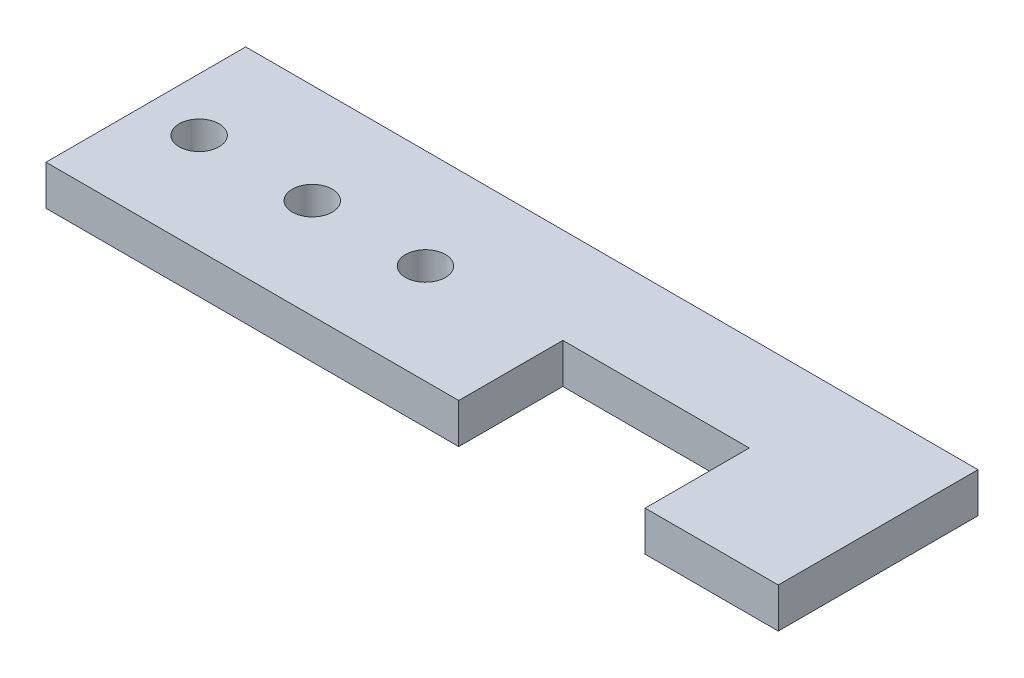
ISO-10303-21;
HEADER;
FILE_DESCRIPTION(('STEP AP214'),'2;1');
FILE_NAME('part.step','',(''),(''),'','','');
FILE_SCHEMA(('AUTOMOTIVE_DESIGN { 1 0 10303 214 1 1 1 1 }'));
ENDSEC;
DATA;
#1=APPLICATION_CONTEXT('core data for automotive mechanical design processes');
#2=APPLICATION_PROTOCOL_DEFINITION('international standard','automotive_design',2000,#1);
#3=PRODUCT_CONTEXT('',#1,'mechanical');
#4=PRODUCT('Part','Part','',(#3));
#5=PRODUCT_RELATED_PRODUCT_CATEGORY('part','',(#4));
#6=PRODUCT_DEFINITION_FORMATION('','',#4);
#7=PRODUCT_DEFINITION_CONTEXT('part definition',#1,'design');
#8=PRODUCT_DEFINITION('design','',#6,#7);
#9=PRODUCT_DEFINITION_SHAPE('','',#8);
#10=(LENGTH_UNIT() NAMED_UNIT(*) SI_UNIT(.MILLI.,.METRE.));
#11=(NAMED_UNIT(*) PLANE_ANGLE_UNIT() SI_UNIT($,.RADIAN.));
#12=(NAMED_UNIT(*) SI_UNIT($,.STERADIAN.) SOLID_ANGLE_UNIT());
#13=UNCERTAINTY_MEASURE_WITH_UNIT(LENGTH_MEASURE(1.E-05),#10,'distance_accuracy_value','');
#14=(GEOMETRIC_REPRESENTATION_CONTEXT(3) GLOBAL_UNCERTAINTY_ASSIGNED_CONTEXT((#13)) GLOBAL_UNIT_ASSIGNED_CONTEXT((#10,
#11,#12)) REPRESENTATION_CONTEXT('',''));
#15=CARTESIAN_POINT('',(0.,0.,0.));
#16=DIRECTION('',(0.,0.,1.));
#17=DIRECTION('',(1.,0.,0.));
#18=AXIS2_PLACEMENT_3D('',#15,#16,#17);
#19=CARTESIAN_POINT('',(0.,3.,-7.82030355510657));
#20=DIRECTION('',(0.,0.,-1.));
#21=DIRECTION('',(-1.,0.,0.));
#22=AXIS2_PLACEMENT_3D('',#19,#20,#21);
#23=PLANE('',#22);
#24=DIRECTION('',(1.,0.,0.));
#25=VECTOR('',#24,1.);
#26=CARTESIAN_POINT('',(0.,0.,-7.82030355510657));
#27=LINE('',#26,#25);
#28=CARTESIAN_POINT('',(31.,0.,-7.82030355510657));
#29=VERTEX_POINT('',#28);
#30=CARTESIAN_POINT('',(45.,0.,-7.82030355510657));
#31=VERTEX_POINT('',#30);
#32=EDGE_CURVE('E143',#29,#31,#27,.T.);
#33=ORIENTED_EDGE('',*,*,#32,.T.);
#34=DIRECTION('',(0.,-1.,0.));
#35=VECTOR('',#34,1.);
#36=CARTESIAN_POINT('',(45.,3.,-7.82030355510657));
#37=LINE('',#36,#35);
#38=CARTESIAN_POINT('',(45.,3.,-7.82030355510657));
#39=VERTEX_POINT('',#38);
#40=EDGE_CURVE('E11',#39,#31,#37,.T.);
#41=ORIENTED_EDGE('',*,*,#40,.F.);
#42=DIRECTION('',(1.,0.,0.));
#43=VECTOR('',#42,1.);
#44=CARTESIAN_POINT('',(0.,3.,-7.82030355510657));
#45=LINE('',#44,#43);
#46=CARTESIAN_POINT('',(31.,3.,-7.82030355510657));
#47=VERTEX_POINT('',#46);
#48=EDGE_CURVE('E183',#47,#39,#45,.T.);
#49=ORIENTED_EDGE('',*,*,#48,.F.);
#50=DIRECTION('',(0.,-1.,0.));
#51=VECTOR('',#50,1.);
#52=CARTESIAN_POINT('',(31.,3.,-7.82030355510657));
#53=LINE('',#52,#51);
#54=EDGE_CURVE('E133',#47,#29,#53,.T.);
#55=ORIENTED_EDGE('',*,*,#54,.T.);
#56=EDGE_LOOP('',(#33,#41,#49,#55));
#57=FACE_BOUND('',#56,.T.);
#58=ADVANCED_FACE('F35',(#57),#23,.F.);
#59=CARTESIAN_POINT('',(45.,3.,0.));
#60=DIRECTION('',(1.,0.,0.));
#61=DIRECTION('',(0.,0.,-1.));
#62=AXIS2_PLACEMENT_3D('',#59,#60,#61);
#63=PLANE('',#62);
#64=DIRECTION('',(0.,0.,1.));
#65=VECTOR('',#64,1.);
#66=CARTESIAN_POINT('',(45.,0.,0.));
#67=LINE('',#66,#65);
#68=CARTESIAN_POINT('',(45.,0.,0.));
#69=VERTEX_POINT('',#68);
#70=EDGE_CURVE('E146',#31,#69,#67,.T.);
#71=ORIENTED_EDGE('',*,*,#70,.T.);
#72=DIRECTION('',(0.,-1.,0.));
#73=VECTOR('',#72,1.);
#74=CARTESIAN_POINT('',(45.,3.,0.));
#75=LINE('',#74,#73);
#76=CARTESIAN_POINT('',(45.,3.,0.));
#77=VERTEX_POINT('',#76);
#78=EDGE_CURVE('E44',#77,#69,#75,.T.);
#79=ORIENTED_EDGE('',*,*,#78,.F.);
#80=DIRECTION('',(0.,0.,1.));
#81=VECTOR('',#80,1.);
#82=CARTESIAN_POINT('',(45.,3.,0.));
#83=LINE('',#82,#81);
#84=EDGE_CURVE('E94',#39,#77,#83,.T.);
#85=ORIENTED_EDGE('',*,*,#84,.F.);
#86=ORIENTED_EDGE('',*,*,#40,.T.);
#87=EDGE_LOOP('',(#71,#79,#85,#86));
#88=FACE_BOUND('',#87,.T.);
#89=ADVANCED_FACE('F219',(#88),#63,.F.);
#90=CARTESIAN_POINT('',(0.,3.,0.));
#91=DIRECTION('',(0.,0.,-1.));
#92=DIRECTION('',(-1.,0.,0.));
#93=AXIS2_PLACEMENT_3D('',#90,#91,#92);
#94=PLANE('',#93);
#95=DIRECTION('',(1.,0.,0.));
#96=VECTOR('',#95,1.);
#97=CARTESIAN_POINT('',(0.,0.,0.));
#98=LINE('',#97,#96);
#99=CARTESIAN_POINT('',(55.,0.,0.));
#100=VERTEX_POINT('',#99);
#101=EDGE_CURVE('E148',#69,#100,#98,.T.);
#102=ORIENTED_EDGE('',*,*,#101,.T.);
#103=DIRECTION('',(0.,-1.,0.));
#104=VECTOR('',#103,1.);
#105=CARTESIAN_POINT('',(55.,3.,0.));
#106=LINE('',#105,#104);
#107=CARTESIAN_POINT('',(55.,3.,0.));
#108=VERTEX_POINT('',#107);
#109=EDGE_CURVE('E164',#108,#100,#106,.T.);
#110=ORIENTED_EDGE('',*,*,#109,.F.);
#111=DIRECTION('',(1.,0.,0.));
#112=VECTOR('',#111,1.);
#113=CARTESIAN_POINT('',(0.,3.,0.));
#114=LINE('',#113,#112);
#115=EDGE_CURVE('E122',#77,#108,#114,.T.);
#116=ORIENTED_EDGE('',*,*,#115,.F.);
#117=ORIENTED_EDGE('',*,*,#78,.T.);
#118=EDGE_LOOP('',(#102,#110,#116,#117));
#119=FACE_BOUND('',#118,.T.);
#120=ADVANCED_FACE('F170',(#119),#94,.F.);
#121=CARTESIAN_POINT('',(55.,3.,0.));
#122=DIRECTION('',(-1.,0.,0.));
#123=DIRECTION('',(0.,0.,1.));
#124=AXIS2_PLACEMENT_3D('',#121,#122,#123);
#125=PLANE('',#124);
#126=DIRECTION('',(0.,0.,-1.));
#127=VECTOR('',#126,1.);
#128=CARTESIAN_POINT('',(55.,0.,0.));
#129=LINE('',#128,#127);
#130=CARTESIAN_POINT('',(55.,0.,-15.));
#131=VERTEX_POINT('',#130);
#132=EDGE_CURVE('E150',#100,#131,#129,.T.);
#133=ORIENTED_EDGE('',*,*,#132,.T.);
#134=DIRECTION('',(0.,-1.,0.));
#135=VECTOR('',#134,1.);
#136=CARTESIAN_POINT('',(55.,3.,-15.));
#137=LINE('',#136,#135);
#138=CARTESIAN_POINT('',(55.,3.,-15.));
#139=VERTEX_POINT('',#138);
#140=EDGE_CURVE('E162',#139,#131,#137,.T.);
#141=ORIENTED_EDGE('',*,*,#140,.F.);
#142=DIRECTION('',(0.,0.,-1.));
#143=VECTOR('',#142,1.);
#144=CARTESIAN_POINT('',(55.,3.,0.));
#145=LINE('',#144,#143);
#146=EDGE_CURVE('E128',#108,#139,#145,.T.);
#147=ORIENTED_EDGE('',*,*,#146,.F.);
#148=ORIENTED_EDGE('',*,*,#109,.T.);
#149=EDGE_LOOP('',(#133,#141,#147,#148));
#150=FACE_BOUND('',#149,.T.);
#151=ADVANCED_FACE('F179',(#150),#125,.F.);
#152=CARTESIAN_POINT('',(0.,3.,-15.));
#153=DIRECTION('',(0.,0.,-1.));
#154=DIRECTION('',(-1.,0.,0.));
#155=AXIS2_PLACEMENT_3D('',#152,#153,#154);
#156=PLANE('',#155);
#157=DIRECTION('',(1.,0.,0.));
#158=VECTOR('',#157,1.);
#159=CARTESIAN_POINT('',(0.,0.,-15.));
#160=LINE('',#159,#158);
#161=CARTESIAN_POINT('',(0.,0.,-15.));
#162=VERTEX_POINT('',#161);
#163=EDGE_CURVE('E153',#162,#131,#160,.T.);
#164=ORIENTED_EDGE('',*,*,#163,.F.);
#165=DIRECTION('',(0.,-1.,0.));
#166=VECTOR('',#165,1.);
#167=CARTESIAN_POINT('',(0.,3.,-15.));
#168=LINE('',#167,#166);
#169=CARTESIAN_POINT('',(0.,3.,-15.));
#170=VERTEX_POINT('',#169);
#171=EDGE_CURVE('E116',#170,#162,#168,.T.);
#172=ORIENTED_EDGE('',*,*,#171,.F.);
#173=DIRECTION('',(1.,0.,0.));
#174=VECTOR('',#173,1.);
#175=CARTESIAN_POINT('',(0.,3.,-15.));
#176=LINE('',#175,#174);
#177=EDGE_CURVE('E126',#170,#139,#176,.T.);
#178=ORIENTED_EDGE('',*,*,#177,.T.);
#179=ORIENTED_EDGE('',*,*,#140,.T.);
#180=EDGE_LOOP('',(#164,#172,#178,#179));
#181=FACE_BOUND('',#180,.T.);
#182=ADVANCED_FACE('F244',(#181),#156,.T.);
#183=CARTESIAN_POINT('',(0.,3.,0.));
#184=DIRECTION('',(-1.,0.,0.));
#185=DIRECTION('',(0.,0.,1.));
#186=AXIS2_PLACEMENT_3D('',#183,#184,#185);
#187=PLANE('',#186);
#188=DIRECTION('',(0.,0.,-1.));
#189=VECTOR('',#188,1.);
#190=CARTESIAN_POINT('',(0.,0.,0.));
#191=LINE('',#190,#189);
#192=CARTESIAN_POINT('',(0.,0.,0.));
#193=VERTEX_POINT('',#192);
#194=EDGE_CURVE('E115',#193,#162,#191,.T.);
#195=ORIENTED_EDGE('',*,*,#194,.F.);
#196=DIRECTION('',(0.,-1.,0.));
#197=VECTOR('',#196,1.);
#198=CARTESIAN_POINT('',(0.,3.,0.));
#199=LINE('',#198,#197);
#200=CARTESIAN_POINT('',(0.,3.,0.));
#201=VERTEX_POINT('',#200);
#202=EDGE_CURVE('E109',#201,#193,#199,.T.);
#203=ORIENTED_EDGE('',*,*,#202,.F.);
#204=DIRECTION('',(0.,0.,-1.));
#205=VECTOR('',#204,1.);
#206=CARTESIAN_POINT('',(0.,3.,0.));
#207=LINE('',#206,#205);
#208=EDGE_CURVE('E113',#201,#170,#207,.T.);
#209=ORIENTED_EDGE('',*,*,#208,.T.);
#210=ORIENTED_EDGE('',*,*,#171,.T.);
#211=EDGE_LOOP('',(#195,#203,#209,#210));
#212=FACE_BOUND('',#211,.T.);
#213=ADVANCED_FACE('F111',(#212),#187,.T.);
#214=CARTESIAN_POINT('',(31.,0.,0.));
#215=VERTEX_POINT('',#214);
#216=EDGE_CURVE('E80',#193,#215,#98,.T.);
#217=ORIENTED_EDGE('',*,*,#216,.T.);
#218=DIRECTION('',(0.,-1.,0.));
#219=VECTOR('',#218,1.);
#220=CARTESIAN_POINT('',(31.,3.,0.));
#221=LINE('',#220,#219);
#222=CARTESIAN_POINT('',(31.,3.,0.));
#223=VERTEX_POINT('',#222);
#224=EDGE_CURVE('E117',#223,#215,#221,.T.);
#225=ORIENTED_EDGE('',*,*,#224,.F.);
#226=EDGE_CURVE('E119',#201,#223,#114,.T.);
#227=ORIENTED_EDGE('',*,*,#226,.F.);
#228=ORIENTED_EDGE('',*,*,#202,.T.);
#229=EDGE_LOOP('',(#217,#225,#227,#228));
#230=FACE_BOUND('',#229,.T.);
#231=ADVANCED_FACE('F120',(#230),#94,.F.);
#232=CARTESIAN_POINT('',(4.,3.,-7.5));
#233=DIRECTION('',(0.,-1.,0.));
#234=DIRECTION('',(0.,0.,-1.));
#235=AXIS2_PLACEMENT_3D('',#232,#233,#234);
#236=CYLINDRICAL_SURFACE('',#235,1.5);
#237=CARTESIAN_POINT('',(4.,3.,-7.5));
#238=DIRECTION('',(0.,1.,0.));
#239=DIRECTION('',(0.,0.,1.));
#240=AXIS2_PLACEMENT_3D('',#237,#238,#239);
#241=CIRCLE('',#240,1.5);
#242=CARTESIAN_POINT('',(4.,3.,-6.));
#243=VERTEX_POINT('',#242);
#244=EDGE_CURVE('E185',#243,#243,#241,.T.);
#245=ORIENTED_EDGE('',*,*,#244,.T.);
#246=EDGE_LOOP('',(#245));
#247=FACE_BOUND('',#246,.T.);
#248=CARTESIAN_POINT('',(4.,0.,-7.5));
#249=DIRECTION('',(0.,1.,0.));
#250=DIRECTION('',(0.,0.,1.));
#251=AXIS2_PLACEMENT_3D('',#248,#249,#250);
#252=CIRCLE('',#251,1.5);
#253=CARTESIAN_POINT('',(4.,0.,-6.));
#254=VERTEX_POINT('',#253);
#255=EDGE_CURVE('E140',#254,#254,#252,.T.);
#256=ORIENTED_EDGE('',*,*,#255,.F.);
#257=EDGE_LOOP('',(#256));
#258=FACE_BOUND('',#257,.T.);
#259=ADVANCED_FACE('F204',(#247,#258),#236,.F.);
#260=CARTESIAN_POINT('',(12.5,3.,-7.5));
#261=DIRECTION('',(0.,-1.,0.));
#262=DIRECTION('',(0.,0.,-1.));
#263=AXIS2_PLACEMENT_3D('',#260,#261,#262);
#264=CYLINDRICAL_SURFACE('',#263,1.5);
#265=CARTESIAN_POINT('',(12.5,3.,-7.5));
#266=DIRECTION('',(0.,1.,0.));
#267=DIRECTION('',(0.,0.,1.));
#268=AXIS2_PLACEMENT_3D('',#265,#266,#267);
#269=CIRCLE('',#268,1.5);
#270=CARTESIAN_POINT('',(12.5,3.,-6.));
#271=VERTEX_POINT('',#270);
#272=EDGE_CURVE('E188',#271,#271,#269,.T.);
#273=ORIENTED_EDGE('',*,*,#272,.T.);
#274=EDGE_LOOP('',(#273));
#275=FACE_BOUND('',#274,.T.);
#276=CARTESIAN_POINT('',(12.5,0.,-7.5));
#277=DIRECTION('',(0.,1.,0.));
#278=DIRECTION('',(0.,0.,1.));
#279=AXIS2_PLACEMENT_3D('',#276,#277,#278);
#280=CIRCLE('',#279,1.5);
#281=CARTESIAN_POINT('',(12.5,0.,-6.));
#282=VERTEX_POINT('',#281);
#283=EDGE_CURVE('E137',#282,#282,#280,.T.);
#284=ORIENTED_EDGE('',*,*,#283,.F.);
#285=EDGE_LOOP('',(#284));
#286=FACE_BOUND('',#285,.T.);
#287=ADVANCED_FACE('F207',(#275,#286),#264,.F.);
#288=CARTESIAN_POINT('',(21.,3.,-7.5));
#289=DIRECTION('',(0.,-1.,0.));
#290=DIRECTION('',(0.,0.,-1.));
#291=AXIS2_PLACEMENT_3D('',#288,#289,#290);
#292=CYLINDRICAL_SURFACE('',#291,1.5);
#293=CARTESIAN_POINT('',(21.,3.,-7.5));
#294=DIRECTION('',(0.,1.,0.));
#295=DIRECTION('',(0.,0.,1.));
#296=AXIS2_PLACEMENT_3D('',#293,#294,#295);
#297=CIRCLE('',#296,1.5);
#298=CARTESIAN_POINT('',(21.,3.,-6.));
#299=VERTEX_POINT('',#298);
#300=EDGE_CURVE('E158',#299,#299,#297,.T.);
#301=ORIENTED_EDGE('',*,*,#300,.T.);
#302=EDGE_LOOP('',(#301));
#303=FACE_BOUND('',#302,.T.);
#304=CARTESIAN_POINT('',(21.,0.,-7.5));
#305=DIRECTION('',(0.,1.,0.));
#306=DIRECTION('',(0.,0.,1.));
#307=AXIS2_PLACEMENT_3D('',#304,#305,#306);
#308=CIRCLE('',#307,1.5);
#309=CARTESIAN_POINT('',(21.,0.,-6.));
#310=VERTEX_POINT('',#309);
#311=EDGE_CURVE('E134',#310,#310,#308,.T.);
#312=ORIENTED_EDGE('',*,*,#311,.F.);
#313=EDGE_LOOP('',(#312));
#314=FACE_BOUND('',#313,.T.);
#315=ADVANCED_FACE('F37',(#303,#314),#292,.F.);
#316=CARTESIAN_POINT('',(31.,3.,0.));
#317=DIRECTION('',(-1.,0.,0.));
#318=DIRECTION('',(0.,0.,1.));
#319=AXIS2_PLACEMENT_3D('',#316,#317,#318);
#320=PLANE('',#319);
#321=DIRECTION('',(0.,0.,-1.));
#322=VECTOR('',#321,1.);
#323=CARTESIAN_POINT('',(31.,0.,0.));
#324=LINE('',#323,#322);
#325=EDGE_CURVE('E86',#215,#29,#324,.T.);
#326=ORIENTED_EDGE('',*,*,#325,.T.);
#327=ORIENTED_EDGE('',*,*,#54,.F.);
#328=DIRECTION('',(0.,0.,-1.));
#329=VECTOR('',#328,1.);
#330=CARTESIAN_POINT('',(31.,3.,0.));
#331=LINE('',#330,#329);
#332=EDGE_CURVE('E52',#223,#47,#331,.T.);
#333=ORIENTED_EDGE('',*,*,#332,.F.);
#334=ORIENTED_EDGE('',*,*,#224,.T.);
#335=EDGE_LOOP('',(#326,#327,#333,#334));
#336=FACE_BOUND('',#335,.T.);
#337=ADVANCED_FACE('F198',(#336),#320,.F.);
#338=CARTESIAN_POINT('',(0.,3.,0.));
#339=DIRECTION('',(0.,1.,0.));
#340=DIRECTION('',(0.,0.,1.));
#341=AXIS2_PLACEMENT_3D('',#338,#339,#340);
#342=PLANE('',#341);
#343=ORIENTED_EDGE('',*,*,#300,.F.);
#344=EDGE_LOOP('',(#343));
#345=FACE_BOUND('',#344,.T.);
#346=ORIENTED_EDGE('',*,*,#272,.F.);
#347=EDGE_LOOP('',(#346));
#348=FACE_BOUND('',#347,.T.);
#349=ORIENTED_EDGE('',*,*,#244,.F.);
#350=EDGE_LOOP('',(#349));
#351=FACE_BOUND('',#350,.T.);
#352=ORIENTED_EDGE('',*,*,#48,.T.);
#353=ORIENTED_EDGE('',*,*,#84,.T.);
#354=ORIENTED_EDGE('',*,*,#115,.T.);
#355=ORIENTED_EDGE('',*,*,#146,.T.);
#356=ORIENTED_EDGE('',*,*,#177,.F.);
#357=ORIENTED_EDGE('',*,*,#208,.F.);
#358=ORIENTED_EDGE('',*,*,#226,.T.);
#359=ORIENTED_EDGE('',*,*,#332,.T.);
#360=EDGE_LOOP('',(#352,#353,#354,#355,#356,#357,#358,#359));
#361=FACE_BOUND('',#360,.T.);
#362=ADVANCED_FACE('F124',(#345,#348,#351,#361),#342,.T.);
#363=CARTESIAN_POINT('',(0.,0.,0.));
#364=DIRECTION('',(0.,1.,0.));
#365=DIRECTION('',(0.,0.,1.));
#366=AXIS2_PLACEMENT_3D('',#363,#364,#365);
#367=PLANE('',#366);
#368=ORIENTED_EDGE('',*,*,#311,.T.);
#369=EDGE_LOOP('',(#368));
#370=FACE_BOUND('',#369,.T.);
#371=ORIENTED_EDGE('',*,*,#283,.T.);
#372=EDGE_LOOP('',(#371));
#373=FACE_BOUND('',#372,.T.);
#374=ORIENTED_EDGE('',*,*,#255,.T.);
#375=EDGE_LOOP('',(#374));
#376=FACE_BOUND('',#375,.T.);
#377=ORIENTED_EDGE('',*,*,#32,.F.);
#378=ORIENTED_EDGE('',*,*,#325,.F.);
#379=ORIENTED_EDGE('',*,*,#216,.F.);
#380=ORIENTED_EDGE('',*,*,#194,.T.);
#381=ORIENTED_EDGE('',*,*,#163,.T.);
#382=ORIENTED_EDGE('',*,*,#132,.F.);
#383=ORIENTED_EDGE('',*,*,#101,.F.);
#384=ORIENTED_EDGE('',*,*,#70,.F.);
#385=EDGE_LOOP('',(#377,#378,#379,#380,#381,#382,#383,#384));
#386=FACE_BOUND('',#385,.T.);
#387=ADVANCED_FACE('F175',(#370,#373,#376,#386),#367,.F.);
#388=CLOSED_SHELL('',(#58,#89,#120,#151,#182,#213,#231,#259,#287,#315,#337,#362,#387));
#389=MANIFOLD_SOLID_BREP('B2',#388);
#390=ADVANCED_BREP_SHAPE_REPRESENTATION('',(#18,#389),#14);
#391=SHAPE_DEFINITION_REPRESENTATION(#9,#390);
ENDSEC;
END-ISO-10303-21;
